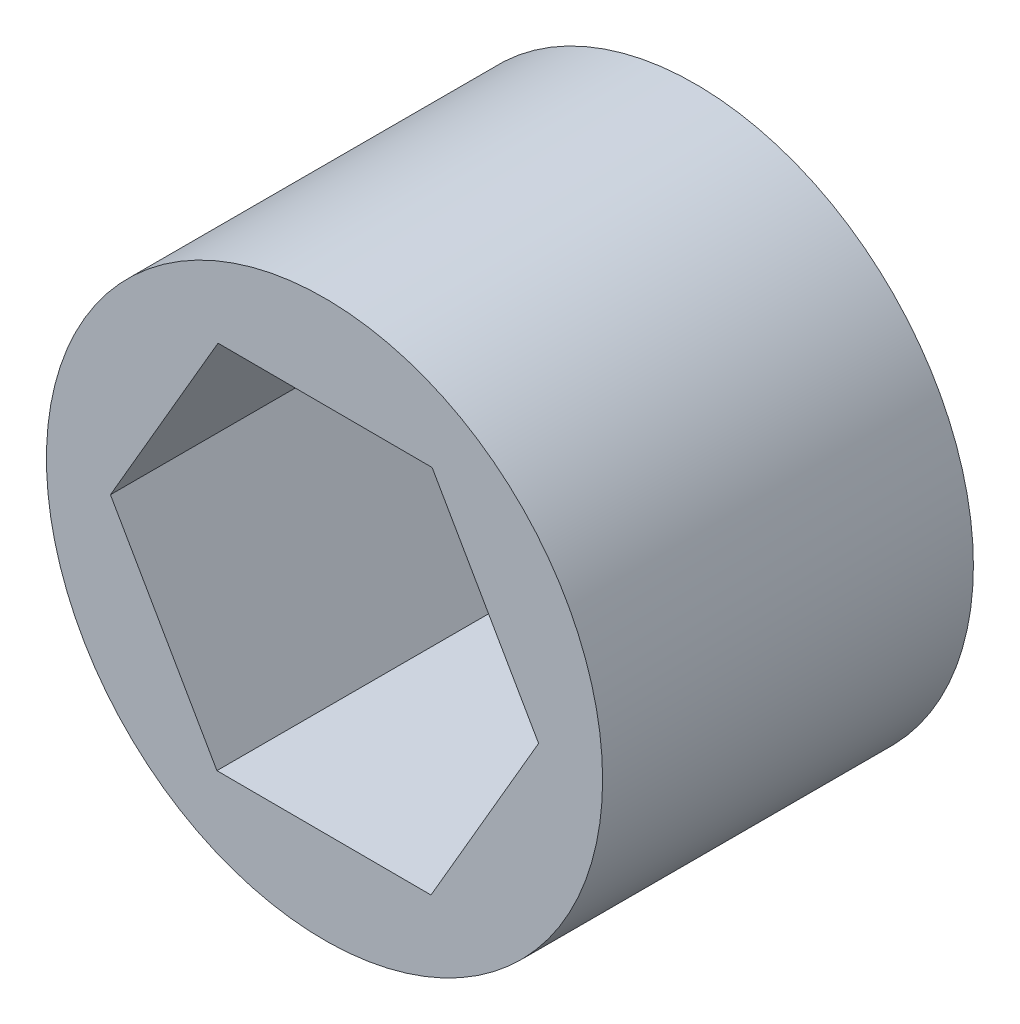
ISO-10303-21;
HEADER;
FILE_DESCRIPTION(('STEP AP214'),'2;1');
FILE_NAME('part.step','',(''),(''),'','','');
FILE_SCHEMA(('AUTOMOTIVE_DESIGN { 1 0 10303 214 1 1 1 1 }'));
ENDSEC;
DATA;
#1=APPLICATION_CONTEXT('core data for automotive mechanical design processes');
#2=APPLICATION_PROTOCOL_DEFINITION('international standard','automotive_design',2000,#1);
#3=PRODUCT_CONTEXT('',#1,'mechanical');
#4=PRODUCT('Part','Part','',(#3));
#5=PRODUCT_RELATED_PRODUCT_CATEGORY('part','',(#4));
#6=PRODUCT_DEFINITION_FORMATION('','',#4);
#7=PRODUCT_DEFINITION_CONTEXT('part definition',#1,'design');
#8=PRODUCT_DEFINITION('design','',#6,#7);
#9=PRODUCT_DEFINITION_SHAPE('','',#8);
#10=(LENGTH_UNIT() NAMED_UNIT(*) SI_UNIT(.MILLI.,.METRE.));
#11=(NAMED_UNIT(*) PLANE_ANGLE_UNIT() SI_UNIT($,.RADIAN.));
#12=(NAMED_UNIT(*) SI_UNIT($,.STERADIAN.) SOLID_ANGLE_UNIT());
#13=UNCERTAINTY_MEASURE_WITH_UNIT(LENGTH_MEASURE(1.E-05),#10,'distance_accuracy_value','');
#14=(GEOMETRIC_REPRESENTATION_CONTEXT(3) GLOBAL_UNCERTAINTY_ASSIGNED_CONTEXT((#13)) GLOBAL_UNIT_ASSIGNED_CONTEXT((#10,
#11,#12)) REPRESENTATION_CONTEXT('',''));
#15=CARTESIAN_POINT('',(0.,0.,0.));
#16=DIRECTION('',(0.,0.,1.));
#17=DIRECTION('',(1.,0.,0.));
#18=AXIS2_PLACEMENT_3D('',#15,#16,#17);
#19=CARTESIAN_POINT('',(0.,0.,12.7));
#20=DIRECTION('',(0.,0.,1.));
#21=DIRECTION('',(1.,0.,0.));
#22=AXIS2_PLACEMENT_3D('',#19,#20,#21);
#23=PLANE('',#22);
#24=CARTESIAN_POINT('',(0.,0.,12.7));
#25=DIRECTION('',(0.,0.,1.));
#26=DIRECTION('',(1.,0.,0.));
#27=AXIS2_PLACEMENT_3D('',#24,#25,#26);
#28=CIRCLE('',#27,9.525);
#29=CARTESIAN_POINT('',(9.525,0.,12.7));
#30=VERTEX_POINT('',#29);
#31=EDGE_CURVE('E11',#30,#30,#28,.T.);
#32=ORIENTED_EDGE('',*,*,#31,.T.);
#33=EDGE_LOOP('',(#32));
#34=FACE_BOUND('',#33,.T.);
#35=DIRECTION('',(0.502611333572125,0.864512491156056,0.));
#36=VECTOR('',#35,1.);
#37=CARTESIAN_POINT('',(3.64699361036975,-6.36103536692381,12.7));
#38=LINE('',#37,#36);
#39=CARTESIAN_POINT('',(3.64699361036975,-6.36103536692381,12.7));
#40=VERTEX_POINT('',#39);
#41=CARTESIAN_POINT('',(7.33231502731217,-0.0221285694421737,12.7));
#42=VERTEX_POINT('',#41);
#43=EDGE_CURVE('E100',#40,#42,#38,.T.);
#44=ORIENTED_EDGE('',*,*,#43,.F.);
#45=DIRECTION('',(0.999995446016177,-0.00301793752540637,0.));
#46=VECTOR('',#45,1.);
#47=CARTESIAN_POINT('',(-3.68532141694241,-6.33890679748164,12.7));
#48=LINE('',#47,#46);
#49=CARTESIAN_POINT('',(-3.68532141694241,-6.33890679748164,12.7));
#50=VERTEX_POINT('',#49);
#51=EDGE_CURVE('E92',#50,#40,#48,.T.);
#52=ORIENTED_EDGE('',*,*,#51,.F.);
#53=DIRECTION('',(0.497384112444053,-0.867530428681462,0.));
#54=VECTOR('',#53,1.);
#55=CARTESIAN_POINT('',(-7.33231502731217,0.022128569442172,12.7));
#56=LINE('',#55,#54);
#57=CARTESIAN_POINT('',(-7.33231502731217,0.022128569442172,12.7));
#58=VERTEX_POINT('',#57);
#59=EDGE_CURVE('E120',#58,#50,#56,.T.);
#60=ORIENTED_EDGE('',*,*,#59,.F.);
#61=DIRECTION('',(-0.502611333572125,-0.864512491156056,0.));
#62=VECTOR('',#61,1.);
#63=CARTESIAN_POINT('',(-3.64699361036976,6.36103536692381,12.7));
#64=LINE('',#63,#62);
#65=CARTESIAN_POINT('',(-3.64699361036976,6.36103536692381,12.7));
#66=VERTEX_POINT('',#65);
#67=EDGE_CURVE('E118',#66,#58,#64,.T.);
#68=ORIENTED_EDGE('',*,*,#67,.F.);
#69=DIRECTION('',(-0.999995446016177,0.00301793752540602,0.));
#70=VECTOR('',#69,1.);
#71=CARTESIAN_POINT('',(3.68532141694241,6.33890679748164,12.7));
#72=LINE('',#71,#70);
#73=CARTESIAN_POINT('',(3.68532141694241,6.33890679748164,12.7));
#74=VERTEX_POINT('',#73);
#75=EDGE_CURVE('E114',#74,#66,#72,.T.);
#76=ORIENTED_EDGE('',*,*,#75,.F.);
#77=DIRECTION('',(-0.497384112444053,0.867530428681462,0.));
#78=VECTOR('',#77,1.);
#79=CARTESIAN_POINT('',(7.33231502731217,-0.0221285694421737,12.7));
#80=LINE('',#79,#78);
#81=EDGE_CURVE('E112',#42,#74,#80,.T.);
#82=ORIENTED_EDGE('',*,*,#81,.F.);
#83=EDGE_LOOP('',(#44,#52,#60,#68,#76,#82));
#84=FACE_BOUND('',#83,.T.);
#85=ADVANCED_FACE('F39',(#34,#84),#23,.T.);
#86=CARTESIAN_POINT('',(0.,0.,0.));
#87=DIRECTION('',(0.,0.,1.));
#88=DIRECTION('',(1.,0.,0.));
#89=AXIS2_PLACEMENT_3D('',#86,#87,#88);
#90=PLANE('',#89);
#91=CARTESIAN_POINT('',(0.,0.,0.));
#92=DIRECTION('',(0.,0.,1.));
#93=DIRECTION('',(1.,0.,0.));
#94=AXIS2_PLACEMENT_3D('',#91,#92,#93);
#95=CIRCLE('',#94,9.525);
#96=CARTESIAN_POINT('',(9.525,0.,0.));
#97=VERTEX_POINT('',#96);
#98=EDGE_CURVE('E43',#97,#97,#95,.T.);
#99=ORIENTED_EDGE('',*,*,#98,.F.);
#100=EDGE_LOOP('',(#99));
#101=FACE_BOUND('',#100,.T.);
#102=DIRECTION('',(0.999995446016177,-0.00301793752540637,0.));
#103=VECTOR('',#102,1.);
#104=CARTESIAN_POINT('',(-3.68532141694241,-6.33890679748164,0.));
#105=LINE('',#104,#103);
#106=CARTESIAN_POINT('',(-3.68532141694241,-6.33890679748164,0.));
#107=VERTEX_POINT('',#106);
#108=CARTESIAN_POINT('',(3.64699361036975,-6.36103536692381,0.));
#109=VERTEX_POINT('',#108);
#110=EDGE_CURVE('E62',#107,#109,#105,.T.);
#111=ORIENTED_EDGE('',*,*,#110,.T.);
#112=DIRECTION('',(0.502611333572125,0.864512491156056,0.));
#113=VECTOR('',#112,1.);
#114=CARTESIAN_POINT('',(3.64699361036975,-6.36103536692381,0.));
#115=LINE('',#114,#113);
#116=CARTESIAN_POINT('',(7.33231502731217,-0.0221285694421737,0.));
#117=VERTEX_POINT('',#116);
#118=EDGE_CURVE('E107',#109,#117,#115,.T.);
#119=ORIENTED_EDGE('',*,*,#118,.T.);
#120=DIRECTION('',(-0.497384112444053,0.867530428681462,0.));
#121=VECTOR('',#120,1.);
#122=CARTESIAN_POINT('',(7.33231502731217,-0.0221285694421737,0.));
#123=LINE('',#122,#121);
#124=CARTESIAN_POINT('',(3.68532141694241,6.33890679748164,0.));
#125=VERTEX_POINT('',#124);
#126=EDGE_CURVE('E124',#117,#125,#123,.T.);
#127=ORIENTED_EDGE('',*,*,#126,.T.);
#128=DIRECTION('',(-0.999995446016177,0.00301793752540602,0.));
#129=VECTOR('',#128,1.);
#130=CARTESIAN_POINT('',(3.68532141694241,6.33890679748164,0.));
#131=LINE('',#130,#129);
#132=CARTESIAN_POINT('',(-3.64699361036976,6.36103536692381,0.));
#133=VERTEX_POINT('',#132);
#134=EDGE_CURVE('E127',#125,#133,#131,.T.);
#135=ORIENTED_EDGE('',*,*,#134,.T.);
#136=DIRECTION('',(-0.502611333572125,-0.864512491156056,0.));
#137=VECTOR('',#136,1.);
#138=CARTESIAN_POINT('',(-3.64699361036976,6.36103536692381,0.));
#139=LINE('',#138,#137);
#140=CARTESIAN_POINT('',(-7.33231502731217,0.022128569442172,0.));
#141=VERTEX_POINT('',#140);
#142=EDGE_CURVE('E130',#133,#141,#139,.T.);
#143=ORIENTED_EDGE('',*,*,#142,.T.);
#144=DIRECTION('',(0.497384112444053,-0.867530428681462,0.));
#145=VECTOR('',#144,1.);
#146=CARTESIAN_POINT('',(-7.33231502731217,0.022128569442172,0.));
#147=LINE('',#146,#145);
#148=EDGE_CURVE('E101',#141,#107,#147,.T.);
#149=ORIENTED_EDGE('',*,*,#148,.T.);
#150=EDGE_LOOP('',(#111,#119,#127,#135,#143,#149));
#151=FACE_BOUND('',#150,.T.);
#152=ADVANCED_FACE('F147',(#101,#151),#90,.F.);
#153=CARTESIAN_POINT('',(0.,0.,12.7));
#154=DIRECTION('',(0.,0.,-1.));
#155=DIRECTION('',(-1.,0.,0.));
#156=AXIS2_PLACEMENT_3D('',#153,#154,#155);
#157=CYLINDRICAL_SURFACE('',#156,9.525);
#158=ORIENTED_EDGE('',*,*,#31,.F.);
#159=EDGE_LOOP('',(#158));
#160=FACE_BOUND('',#159,.T.);
#161=ORIENTED_EDGE('',*,*,#98,.T.);
#162=EDGE_LOOP('',(#161));
#163=FACE_BOUND('',#162,.T.);
#164=ADVANCED_FACE('F41',(#160,#163),#157,.T.);
#165=CARTESIAN_POINT('',(-3.68532141694241,-6.33890679748164,12.7));
#166=DIRECTION('',(0.00301793752540637,0.999995446016177,0.));
#167=DIRECTION('',(-0.999995446016177,0.00301793752540637,0.));
#168=AXIS2_PLACEMENT_3D('',#165,#166,#167);
#169=PLANE('',#168);
#170=ORIENTED_EDGE('',*,*,#110,.F.);
#171=DIRECTION('',(0.,0.,-1.));
#172=VECTOR('',#171,1.);
#173=CARTESIAN_POINT('',(-3.68532141694241,-6.33890679748164,12.7));
#174=LINE('',#173,#172);
#175=EDGE_CURVE('E96',#50,#107,#174,.T.);
#176=ORIENTED_EDGE('',*,*,#175,.F.);
#177=ORIENTED_EDGE('',*,*,#51,.T.);
#178=DIRECTION('',(0.,0.,-1.));
#179=VECTOR('',#178,1.);
#180=CARTESIAN_POINT('',(3.64699361036975,-6.36103536692381,12.7));
#181=LINE('',#180,#179);
#182=EDGE_CURVE('E95',#40,#109,#181,.T.);
#183=ORIENTED_EDGE('',*,*,#182,.T.);
#184=EDGE_LOOP('',(#170,#176,#177,#183));
#185=FACE_BOUND('',#184,.T.);
#186=ADVANCED_FACE('F94',(#185),#169,.T.);
#187=CARTESIAN_POINT('',(3.64699361036975,-6.36103536692381,12.7));
#188=DIRECTION('',(-0.864512491156056,0.502611333572125,0.));
#189=DIRECTION('',(-0.502611333572125,-0.864512491156056,0.));
#190=AXIS2_PLACEMENT_3D('',#187,#188,#189);
#191=PLANE('',#190);
#192=ORIENTED_EDGE('',*,*,#118,.F.);
#193=ORIENTED_EDGE('',*,*,#182,.F.);
#194=ORIENTED_EDGE('',*,*,#43,.T.);
#195=DIRECTION('',(0.,0.,-1.));
#196=VECTOR('',#195,1.);
#197=CARTESIAN_POINT('',(7.33231502731217,-0.0221285694421737,12.7));
#198=LINE('',#197,#196);
#199=EDGE_CURVE('E108',#42,#117,#198,.T.);
#200=ORIENTED_EDGE('',*,*,#199,.T.);
#201=EDGE_LOOP('',(#192,#193,#194,#200));
#202=FACE_BOUND('',#201,.T.);
#203=ADVANCED_FACE('F104',(#202),#191,.T.);
#204=CARTESIAN_POINT('',(7.33231502731217,-0.0221285694421737,12.7));
#205=DIRECTION('',(-0.867530428681462,-0.497384112444053,0.));
#206=DIRECTION('',(0.497384112444053,-0.867530428681462,0.));
#207=AXIS2_PLACEMENT_3D('',#204,#205,#206);
#208=PLANE('',#207);
#209=ORIENTED_EDGE('',*,*,#126,.F.);
#210=ORIENTED_EDGE('',*,*,#199,.F.);
#211=ORIENTED_EDGE('',*,*,#81,.T.);
#212=DIRECTION('',(0.,0.,-1.));
#213=VECTOR('',#212,1.);
#214=CARTESIAN_POINT('',(3.68532141694241,6.33890679748164,12.7));
#215=LINE('',#214,#213);
#216=EDGE_CURVE('E139',#74,#125,#215,.T.);
#217=ORIENTED_EDGE('',*,*,#216,.T.);
#218=EDGE_LOOP('',(#209,#210,#211,#217));
#219=FACE_BOUND('',#218,.T.);
#220=ADVANCED_FACE('F143',(#219),#208,.T.);
#221=CARTESIAN_POINT('',(3.68532141694241,6.33890679748164,12.7));
#222=DIRECTION('',(-0.00301793752540602,-0.999995446016177,0.));
#223=DIRECTION('',(0.999995446016177,-0.00301793752540602,0.));
#224=AXIS2_PLACEMENT_3D('',#221,#222,#223);
#225=PLANE('',#224);
#226=ORIENTED_EDGE('',*,*,#134,.F.);
#227=ORIENTED_EDGE('',*,*,#216,.F.);
#228=ORIENTED_EDGE('',*,*,#75,.T.);
#229=DIRECTION('',(0.,0.,-1.));
#230=VECTOR('',#229,1.);
#231=CARTESIAN_POINT('',(-3.64699361036976,6.36103536692381,12.7));
#232=LINE('',#231,#230);
#233=EDGE_CURVE('E137',#66,#133,#232,.T.);
#234=ORIENTED_EDGE('',*,*,#233,.T.);
#235=EDGE_LOOP('',(#226,#227,#228,#234));
#236=FACE_BOUND('',#235,.T.);
#237=ADVANCED_FACE('F155',(#236),#225,.T.);
#238=CARTESIAN_POINT('',(-3.64699361036976,6.36103536692381,12.7));
#239=DIRECTION('',(0.864512491156056,-0.502611333572125,0.));
#240=DIRECTION('',(0.502611333572125,0.864512491156056,0.));
#241=AXIS2_PLACEMENT_3D('',#238,#239,#240);
#242=PLANE('',#241);
#243=ORIENTED_EDGE('',*,*,#142,.F.);
#244=ORIENTED_EDGE('',*,*,#233,.F.);
#245=ORIENTED_EDGE('',*,*,#67,.T.);
#246=DIRECTION('',(0.,0.,-1.));
#247=VECTOR('',#246,1.);
#248=CARTESIAN_POINT('',(-7.33231502731217,0.022128569442172,12.7));
#249=LINE('',#248,#247);
#250=EDGE_CURVE('E54',#58,#141,#249,.T.);
#251=ORIENTED_EDGE('',*,*,#250,.T.);
#252=EDGE_LOOP('',(#243,#244,#245,#251));
#253=FACE_BOUND('',#252,.T.);
#254=ADVANCED_FACE('F153',(#253),#242,.T.);
#255=CARTESIAN_POINT('',(-7.33231502731217,0.022128569442172,12.7));
#256=DIRECTION('',(0.867530428681462,0.497384112444053,0.));
#257=DIRECTION('',(-0.497384112444053,0.867530428681462,0.));
#258=AXIS2_PLACEMENT_3D('',#255,#256,#257);
#259=PLANE('',#258);
#260=ORIENTED_EDGE('',*,*,#148,.F.);
#261=ORIENTED_EDGE('',*,*,#250,.F.);
#262=ORIENTED_EDGE('',*,*,#59,.T.);
#263=ORIENTED_EDGE('',*,*,#175,.T.);
#264=EDGE_LOOP('',(#260,#261,#262,#263));
#265=FACE_BOUND('',#264,.T.);
#266=ADVANCED_FACE('F149',(#265),#259,.T.);
#267=CLOSED_SHELL('',(#85,#152,#164,#186,#203,#220,#237,#254,#266));
#268=MANIFOLD_SOLID_BREP('B2',#267);
#269=ADVANCED_BREP_SHAPE_REPRESENTATION('',(#18,#268),#14);
#270=SHAPE_DEFINITION_REPRESENTATION(#9,#269);
ENDSEC;
END-ISO-10303-21;
